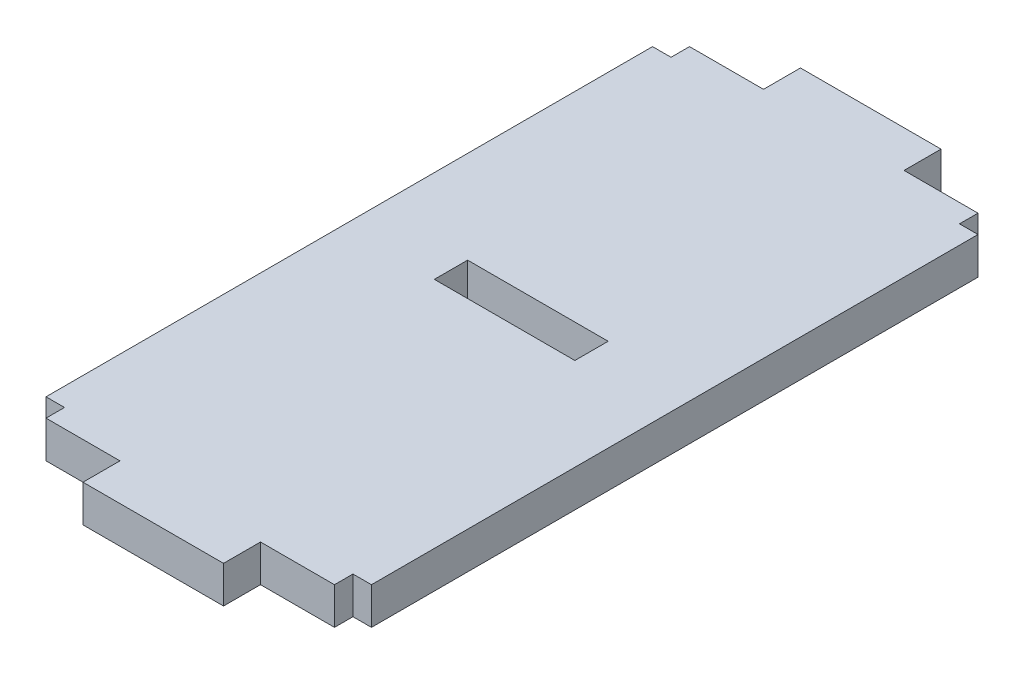
ISO-10303-21;
HEADER;
FILE_DESCRIPTION(('STEP AP214'),'2;1');
FILE_NAME('part.step','',(''),(''),'','','');
FILE_SCHEMA(('AUTOMOTIVE_DESIGN { 1 0 10303 214 1 1 1 1 }'));
ENDSEC;
DATA;
#1=APPLICATION_CONTEXT('core data for automotive mechanical design processes');
#2=APPLICATION_PROTOCOL_DEFINITION('international standard','automotive_design',2000,#1);
#3=PRODUCT_CONTEXT('',#1,'mechanical');
#4=PRODUCT('Part','Part','',(#3));
#5=PRODUCT_RELATED_PRODUCT_CATEGORY('part','',(#4));
#6=PRODUCT_DEFINITION_FORMATION('','',#4);
#7=PRODUCT_DEFINITION_CONTEXT('part definition',#1,'design');
#8=PRODUCT_DEFINITION('design','',#6,#7);
#9=PRODUCT_DEFINITION_SHAPE('','',#8);
#10=(LENGTH_UNIT() NAMED_UNIT(*) SI_UNIT(.MILLI.,.METRE.));
#11=(NAMED_UNIT(*) PLANE_ANGLE_UNIT() SI_UNIT($,.RADIAN.));
#12=(NAMED_UNIT(*) SI_UNIT($,.STERADIAN.) SOLID_ANGLE_UNIT());
#13=UNCERTAINTY_MEASURE_WITH_UNIT(LENGTH_MEASURE(1.E-05),#10,'distance_accuracy_value','');
#14=(GEOMETRIC_REPRESENTATION_CONTEXT(3) GLOBAL_UNCERTAINTY_ASSIGNED_CONTEXT((#13)) GLOBAL_UNIT_ASSIGNED_CONTEXT((#10,
#11,#12)) REPRESENTATION_CONTEXT('',''));
#15=CARTESIAN_POINT('',(0.,0.,0.));
#16=DIRECTION('',(0.,0.,1.));
#17=DIRECTION('',(1.,0.,0.));
#18=AXIS2_PLACEMENT_3D('',#15,#16,#17);
#19=CARTESIAN_POINT('',(0.,2.,-18.8));
#20=DIRECTION('',(0.,0.,-1.));
#21=DIRECTION('',(-1.,0.,0.));
#22=AXIS2_PLACEMENT_3D('',#19,#20,#21);
#23=PLANE('',#22);
#24=DIRECTION('',(1.,0.,0.));
#25=VECTOR('',#24,1.);
#26=CARTESIAN_POINT('',(0.,0.,-18.8));
#27=LINE('',#26,#25);
#28=CARTESIAN_POINT('',(5.,0.,-18.8));
#29=VERTEX_POINT('',#28);
#30=CARTESIAN_POINT('',(12.6,0.,-18.8));
#31=VERTEX_POINT('',#30);
#32=EDGE_CURVE('E279',#29,#31,#27,.T.);
#33=ORIENTED_EDGE('',*,*,#32,.T.);
#34=DIRECTION('',(0.,-1.,0.));
#35=VECTOR('',#34,1.);
#36=CARTESIAN_POINT('',(12.6,2.,-18.8));
#37=LINE('',#36,#35);
#38=CARTESIAN_POINT('',(12.6,2.,-18.8));
#39=VERTEX_POINT('',#38);
#40=EDGE_CURVE('E11',#39,#31,#37,.T.);
#41=ORIENTED_EDGE('',*,*,#40,.F.);
#42=DIRECTION('',(1.,0.,0.));
#43=VECTOR('',#42,1.);
#44=CARTESIAN_POINT('',(0.,2.,-18.8));
#45=LINE('',#44,#43);
#46=CARTESIAN_POINT('',(5.,2.,-18.8));
#47=VERTEX_POINT('',#46);
#48=EDGE_CURVE('E209',#47,#39,#45,.T.);
#49=ORIENTED_EDGE('',*,*,#48,.F.);
#50=DIRECTION('',(0.,-1.,0.));
#51=VECTOR('',#50,1.);
#52=CARTESIAN_POINT('',(5.,2.,-18.8));
#53=LINE('',#52,#51);
#54=EDGE_CURVE('E53',#47,#29,#53,.T.);
#55=ORIENTED_EDGE('',*,*,#54,.T.);
#56=EDGE_LOOP('',(#33,#41,#49,#55));
#57=FACE_BOUND('',#56,.T.);
#58=ADVANCED_FACE('F34',(#57),#23,.F.);
#59=CARTESIAN_POINT('',(12.6,2.,0.));
#60=DIRECTION('',(1.,0.,0.));
#61=DIRECTION('',(0.,0.,-1.));
#62=AXIS2_PLACEMENT_3D('',#59,#60,#61);
#63=PLANE('',#62);
#64=DIRECTION('',(0.,0.,1.));
#65=VECTOR('',#64,1.);
#66=CARTESIAN_POINT('',(12.6,0.,0.));
#67=LINE('',#66,#65);
#68=CARTESIAN_POINT('',(12.6,0.,-17.));
#69=VERTEX_POINT('',#68);
#70=EDGE_CURVE('E215',#31,#69,#67,.T.);
#71=ORIENTED_EDGE('',*,*,#70,.T.);
#72=DIRECTION('',(0.,-1.,0.));
#73=VECTOR('',#72,1.);
#74=CARTESIAN_POINT('',(12.6,2.,-17.));
#75=LINE('',#74,#73);
#76=CARTESIAN_POINT('',(12.6,2.,-17.));
#77=VERTEX_POINT('',#76);
#78=EDGE_CURVE('E44',#77,#69,#75,.T.);
#79=ORIENTED_EDGE('',*,*,#78,.F.);
#80=DIRECTION('',(0.,0.,1.));
#81=VECTOR('',#80,1.);
#82=CARTESIAN_POINT('',(12.6,2.,0.));
#83=LINE('',#82,#81);
#84=EDGE_CURVE('E203',#39,#77,#83,.T.);
#85=ORIENTED_EDGE('',*,*,#84,.F.);
#86=ORIENTED_EDGE('',*,*,#40,.T.);
#87=EDGE_LOOP('',(#71,#79,#85,#86));
#88=FACE_BOUND('',#87,.T.);
#89=ADVANCED_FACE('F214',(#88),#63,.F.);
#90=CARTESIAN_POINT('',(0.,2.,-17.));
#91=DIRECTION('',(0.,0.,-1.));
#92=DIRECTION('',(-1.,0.,0.));
#93=AXIS2_PLACEMENT_3D('',#90,#91,#92);
#94=PLANE('',#93);
#95=DIRECTION('',(1.,0.,0.));
#96=VECTOR('',#95,1.);
#97=CARTESIAN_POINT('',(0.,0.,-17.));
#98=LINE('',#97,#96);
#99=CARTESIAN_POINT('',(5.,0.,-17.));
#100=VERTEX_POINT('',#99);
#101=EDGE_CURVE('E282',#100,#69,#98,.T.);
#102=ORIENTED_EDGE('',*,*,#101,.F.);
#103=DIRECTION('',(0.,-1.,0.));
#104=VECTOR('',#103,1.);
#105=CARTESIAN_POINT('',(5.,2.,-17.));
#106=LINE('',#105,#104);
#107=CARTESIAN_POINT('',(5.,2.,-17.));
#108=VERTEX_POINT('',#107);
#109=EDGE_CURVE('E127',#108,#100,#106,.T.);
#110=ORIENTED_EDGE('',*,*,#109,.F.);
#111=DIRECTION('',(1.,0.,0.));
#112=VECTOR('',#111,1.);
#113=CARTESIAN_POINT('',(0.,2.,-17.));
#114=LINE('',#113,#112);
#115=EDGE_CURVE('E208',#108,#77,#114,.T.);
#116=ORIENTED_EDGE('',*,*,#115,.T.);
#117=ORIENTED_EDGE('',*,*,#78,.T.);
#118=EDGE_LOOP('',(#102,#110,#116,#117));
#119=FACE_BOUND('',#118,.T.);
#120=ADVANCED_FACE('F219',(#119),#94,.T.);
#121=CARTESIAN_POINT('',(1.,2.,0.));
#122=DIRECTION('',(-1.,0.,0.));
#123=DIRECTION('',(0.,0.,1.));
#124=AXIS2_PLACEMENT_3D('',#121,#122,#123);
#125=PLANE('',#124);
#126=DIRECTION('',(0.,0.,-1.));
#127=VECTOR('',#126,1.);
#128=CARTESIAN_POINT('',(1.,0.,0.));
#129=LINE('',#128,#127);
#130=CARTESIAN_POINT('',(1.,0.,0.));
#131=VERTEX_POINT('',#130);
#132=CARTESIAN_POINT('',(1.,0.,-1.));
#133=VERTEX_POINT('',#132);
#134=EDGE_CURVE('E226',#131,#133,#129,.T.);
#135=ORIENTED_EDGE('',*,*,#134,.F.);
#136=DIRECTION('',(0.,-1.,0.));
#137=VECTOR('',#136,1.);
#138=CARTESIAN_POINT('',(1.,2.,0.));
#139=LINE('',#138,#137);
#140=CARTESIAN_POINT('',(1.,2.,0.));
#141=VERTEX_POINT('',#140);
#142=EDGE_CURVE('E38',#141,#131,#139,.T.);
#143=ORIENTED_EDGE('',*,*,#142,.F.);
#144=DIRECTION('',(0.,0.,-1.));
#145=VECTOR('',#144,1.);
#146=CARTESIAN_POINT('',(1.,2.,0.));
#147=LINE('',#146,#145);
#148=CARTESIAN_POINT('',(1.,2.,-1.));
#149=VERTEX_POINT('',#148);
#150=EDGE_CURVE('E287',#141,#149,#147,.T.);
#151=ORIENTED_EDGE('',*,*,#150,.T.);
#152=DIRECTION('',(0.,-1.,0.));
#153=VECTOR('',#152,1.);
#154=CARTESIAN_POINT('',(1.,2.,-1.));
#155=LINE('',#154,#153);
#156=EDGE_CURVE('E222',#149,#133,#155,.T.);
#157=ORIENTED_EDGE('',*,*,#156,.T.);
#158=EDGE_LOOP('',(#135,#143,#151,#157));
#159=FACE_BOUND('',#158,.T.);
#160=ADVANCED_FACE('F36',(#159),#125,.T.);
#161=CARTESIAN_POINT('',(0.,2.,0.));
#162=DIRECTION('',(0.,0.,-1.));
#163=DIRECTION('',(-1.,0.,0.));
#164=AXIS2_PLACEMENT_3D('',#161,#162,#163);
#165=PLANE('',#164);
#166=DIRECTION('',(1.,0.,0.));
#167=VECTOR('',#166,1.);
#168=CARTESIAN_POINT('',(0.,0.,0.));
#169=LINE('',#168,#167);
#170=CARTESIAN_POINT('',(5.,0.,0.));
#171=VERTEX_POINT('',#170);
#172=EDGE_CURVE('E229',#131,#171,#169,.T.);
#173=ORIENTED_EDGE('',*,*,#172,.T.);
#174=DIRECTION('',(0.,-1.,0.));
#175=VECTOR('',#174,1.);
#176=CARTESIAN_POINT('',(5.,2.,0.));
#177=LINE('',#176,#175);
#178=CARTESIAN_POINT('',(5.,2.,0.));
#179=VERTEX_POINT('',#178);
#180=EDGE_CURVE('E327',#179,#171,#177,.T.);
#181=ORIENTED_EDGE('',*,*,#180,.F.);
#182=DIRECTION('',(1.,0.,0.));
#183=VECTOR('',#182,1.);
#184=CARTESIAN_POINT('',(0.,2.,0.));
#185=LINE('',#184,#183);
#186=EDGE_CURVE('E336',#141,#179,#185,.T.);
#187=ORIENTED_EDGE('',*,*,#186,.F.);
#188=ORIENTED_EDGE('',*,*,#142,.T.);
#189=EDGE_LOOP('',(#173,#181,#187,#188));
#190=FACE_BOUND('',#189,.T.);
#191=ADVANCED_FACE('F335',(#190),#165,.F.);
#192=CARTESIAN_POINT('',(5.,2.,0.));
#193=DIRECTION('',(1.,0.,0.));
#194=DIRECTION('',(0.,0.,-1.));
#195=AXIS2_PLACEMENT_3D('',#192,#193,#194);
#196=PLANE('',#195);
#197=DIRECTION('',(0.,0.,1.));
#198=VECTOR('',#197,1.);
#199=CARTESIAN_POINT('',(5.,0.,0.));
#200=LINE('',#199,#198);
#201=CARTESIAN_POINT('',(5.,0.,2.));
#202=VERTEX_POINT('',#201);
#203=EDGE_CURVE('E231',#171,#202,#200,.T.);
#204=ORIENTED_EDGE('',*,*,#203,.T.);
#205=DIRECTION('',(0.,-1.,0.));
#206=VECTOR('',#205,1.);
#207=CARTESIAN_POINT('',(5.,2.,2.));
#208=LINE('',#207,#206);
#209=CARTESIAN_POINT('',(5.,2.,2.));
#210=VERTEX_POINT('',#209);
#211=EDGE_CURVE('E325',#210,#202,#208,.T.);
#212=ORIENTED_EDGE('',*,*,#211,.F.);
#213=DIRECTION('',(0.,0.,1.));
#214=VECTOR('',#213,1.);
#215=CARTESIAN_POINT('',(5.,2.,0.));
#216=LINE('',#215,#214);
#217=EDGE_CURVE('E434',#179,#210,#216,.T.);
#218=ORIENTED_EDGE('',*,*,#217,.F.);
#219=ORIENTED_EDGE('',*,*,#180,.T.);
#220=EDGE_LOOP('',(#204,#212,#218,#219));
#221=FACE_BOUND('',#220,.T.);
#222=ADVANCED_FACE('F433',(#221),#196,.F.);
#223=CARTESIAN_POINT('',(0.,2.,2.));
#224=DIRECTION('',(0.,0.,-1.));
#225=DIRECTION('',(-1.,0.,0.));
#226=AXIS2_PLACEMENT_3D('',#223,#224,#225);
#227=PLANE('',#226);
#228=DIRECTION('',(1.,0.,0.));
#229=VECTOR('',#228,1.);
#230=CARTESIAN_POINT('',(0.,0.,2.));
#231=LINE('',#230,#229);
#232=CARTESIAN_POINT('',(12.6,0.,2.));
#233=VERTEX_POINT('',#232);
#234=EDGE_CURVE('E234',#202,#233,#231,.T.);
#235=ORIENTED_EDGE('',*,*,#234,.T.);
#236=DIRECTION('',(0.,-1.,0.));
#237=VECTOR('',#236,1.);
#238=CARTESIAN_POINT('',(12.6,2.,2.));
#239=LINE('',#238,#237);
#240=CARTESIAN_POINT('',(12.6,2.,2.));
#241=VERTEX_POINT('',#240);
#242=EDGE_CURVE('E323',#241,#233,#239,.T.);
#243=ORIENTED_EDGE('',*,*,#242,.F.);
#244=DIRECTION('',(1.,0.,0.));
#245=VECTOR('',#244,1.);
#246=CARTESIAN_POINT('',(0.,2.,2.));
#247=LINE('',#246,#245);
#248=EDGE_CURVE('E432',#210,#241,#247,.T.);
#249=ORIENTED_EDGE('',*,*,#248,.F.);
#250=ORIENTED_EDGE('',*,*,#211,.T.);
#251=EDGE_LOOP('',(#235,#243,#249,#250));
#252=FACE_BOUND('',#251,.T.);
#253=ADVANCED_FACE('F430',(#252),#227,.F.);
#254=CARTESIAN_POINT('',(12.6,2.,0.));
#255=DIRECTION('',(1.,0.,0.));
#256=DIRECTION('',(0.,0.,-1.));
#257=AXIS2_PLACEMENT_3D('',#254,#255,#256);
#258=PLANE('',#257);
#259=DIRECTION('',(0.,0.,1.));
#260=VECTOR('',#259,1.);
#261=CARTESIAN_POINT('',(12.6,0.,0.));
#262=LINE('',#261,#260);
#263=CARTESIAN_POINT('',(12.6,0.,0.));
#264=VERTEX_POINT('',#263);
#265=EDGE_CURVE('E237',#264,#233,#262,.T.);
#266=ORIENTED_EDGE('',*,*,#265,.F.);
#267=DIRECTION('',(0.,-1.,0.));
#268=VECTOR('',#267,1.);
#269=CARTESIAN_POINT('',(12.6,2.,0.));
#270=LINE('',#269,#268);
#271=CARTESIAN_POINT('',(12.6,2.,0.));
#272=VERTEX_POINT('',#271);
#273=EDGE_CURVE('E321',#272,#264,#270,.T.);
#274=ORIENTED_EDGE('',*,*,#273,.F.);
#275=DIRECTION('',(0.,0.,1.));
#276=VECTOR('',#275,1.);
#277=CARTESIAN_POINT('',(12.6,2.,0.));
#278=LINE('',#277,#276);
#279=EDGE_CURVE('E427',#272,#241,#278,.T.);
#280=ORIENTED_EDGE('',*,*,#279,.T.);
#281=ORIENTED_EDGE('',*,*,#242,.T.);
#282=EDGE_LOOP('',(#266,#274,#280,#281));
#283=FACE_BOUND('',#282,.T.);
#284=ADVANCED_FACE('F422',(#283),#258,.T.);
#285=CARTESIAN_POINT('',(16.6,0.,0.));
#286=VERTEX_POINT('',#285);
#287=EDGE_CURVE('E232',#264,#286,#169,.T.);
#288=ORIENTED_EDGE('',*,*,#287,.T.);
#289=DIRECTION('',(0.,-1.,0.));
#290=VECTOR('',#289,1.);
#291=CARTESIAN_POINT('',(16.6,2.,0.));
#292=LINE('',#291,#290);
#293=CARTESIAN_POINT('',(16.6,2.,0.));
#294=VERTEX_POINT('',#293);
#295=EDGE_CURVE('E318',#294,#286,#292,.T.);
#296=ORIENTED_EDGE('',*,*,#295,.F.);
#297=EDGE_CURVE('E439',#272,#294,#185,.T.);
#298=ORIENTED_EDGE('',*,*,#297,.F.);
#299=ORIENTED_EDGE('',*,*,#273,.T.);
#300=EDGE_LOOP('',(#288,#296,#298,#299));
#301=FACE_BOUND('',#300,.T.);
#302=ADVANCED_FACE('F621',(#301),#165,.F.);
#303=CARTESIAN_POINT('',(16.6,2.,0.));
#304=DIRECTION('',(-1.,0.,0.));
#305=DIRECTION('',(0.,0.,1.));
#306=AXIS2_PLACEMENT_3D('',#303,#304,#305);
#307=PLANE('',#306);
#308=DIRECTION('',(0.,0.,-1.));
#309=VECTOR('',#308,1.);
#310=CARTESIAN_POINT('',(16.6,0.,0.));
#311=LINE('',#310,#309);
#312=CARTESIAN_POINT('',(16.6,0.,-1.));
#313=VERTEX_POINT('',#312);
#314=EDGE_CURVE('E240',#286,#313,#311,.T.);
#315=ORIENTED_EDGE('',*,*,#314,.T.);
#316=DIRECTION('',(0.,-1.,0.));
#317=VECTOR('',#316,1.);
#318=CARTESIAN_POINT('',(16.6,2.,-1.));
#319=LINE('',#318,#317);
#320=CARTESIAN_POINT('',(16.6,2.,-1.));
#321=VERTEX_POINT('',#320);
#322=EDGE_CURVE('E316',#321,#313,#319,.T.);
#323=ORIENTED_EDGE('',*,*,#322,.F.);
#324=DIRECTION('',(0.,0.,-1.));
#325=VECTOR('',#324,1.);
#326=CARTESIAN_POINT('',(16.6,2.,0.));
#327=LINE('',#326,#325);
#328=EDGE_CURVE('E443',#294,#321,#327,.T.);
#329=ORIENTED_EDGE('',*,*,#328,.F.);
#330=ORIENTED_EDGE('',*,*,#295,.T.);
#331=EDGE_LOOP('',(#315,#323,#329,#330));
#332=FACE_BOUND('',#331,.T.);
#333=ADVANCED_FACE('F416',(#332),#307,.F.);
#334=CARTESIAN_POINT('',(0.,2.,-0.999999999999996));
#335=DIRECTION('',(0.,0.,1.));
#336=DIRECTION('',(1.,0.,0.));
#337=AXIS2_PLACEMENT_3D('',#334,#335,#336);
#338=PLANE('',#337);
#339=DIRECTION('',(-1.,0.,0.));
#340=VECTOR('',#339,1.);
#341=CARTESIAN_POINT('',(0.,0.,-0.999999999999996));
#342=LINE('',#341,#340);
#343=CARTESIAN_POINT('',(17.6,0.,-1.));
#344=VERTEX_POINT('',#343);
#345=EDGE_CURVE('E243',#344,#313,#342,.T.);
#346=ORIENTED_EDGE('',*,*,#345,.F.);
#347=DIRECTION('',(0.,-1.,0.));
#348=VECTOR('',#347,1.);
#349=CARTESIAN_POINT('',(17.6,2.,-1.));
#350=LINE('',#349,#348);
#351=CARTESIAN_POINT('',(17.6,2.,-1.));
#352=VERTEX_POINT('',#351);
#353=EDGE_CURVE('E314',#352,#344,#350,.T.);
#354=ORIENTED_EDGE('',*,*,#353,.F.);
#355=DIRECTION('',(-1.,0.,0.));
#356=VECTOR('',#355,1.);
#357=CARTESIAN_POINT('',(0.,2.,-0.999999999999996));
#358=LINE('',#357,#356);
#359=EDGE_CURVE('E413',#352,#321,#358,.T.);
#360=ORIENTED_EDGE('',*,*,#359,.T.);
#361=ORIENTED_EDGE('',*,*,#322,.T.);
#362=EDGE_LOOP('',(#346,#354,#360,#361));
#363=FACE_BOUND('',#362,.T.);
#364=ADVANCED_FACE('F408',(#363),#338,.T.);
#365=CARTESIAN_POINT('',(17.6,2.,0.));
#366=DIRECTION('',(-1.,0.,0.));
#367=DIRECTION('',(0.,0.,1.));
#368=AXIS2_PLACEMENT_3D('',#365,#366,#367);
#369=PLANE('',#368);
#370=DIRECTION('',(0.,0.,-1.));
#371=VECTOR('',#370,1.);
#372=CARTESIAN_POINT('',(17.6,0.,0.));
#373=LINE('',#372,#371);
#374=CARTESIAN_POINT('',(17.6,0.,-33.8));
#375=VERTEX_POINT('',#374);
#376=EDGE_CURVE('E246',#344,#375,#373,.T.);
#377=ORIENTED_EDGE('',*,*,#376,.T.);
#378=DIRECTION('',(0.,-1.,0.));
#379=VECTOR('',#378,1.);
#380=CARTESIAN_POINT('',(17.6,2.,-33.8));
#381=LINE('',#380,#379);
#382=CARTESIAN_POINT('',(17.6,2.,-33.8));
#383=VERTEX_POINT('',#382);
#384=EDGE_CURVE('E311',#383,#375,#381,.T.);
#385=ORIENTED_EDGE('',*,*,#384,.F.);
#386=DIRECTION('',(0.,0.,-1.));
#387=VECTOR('',#386,1.);
#388=CARTESIAN_POINT('',(17.6,2.,0.));
#389=LINE('',#388,#387);
#390=EDGE_CURVE('E446',#352,#383,#389,.T.);
#391=ORIENTED_EDGE('',*,*,#390,.F.);
#392=ORIENTED_EDGE('',*,*,#353,.T.);
#393=EDGE_LOOP('',(#377,#385,#391,#392));
#394=FACE_BOUND('',#393,.T.);
#395=ADVANCED_FACE('F596',(#394),#369,.F.);
#396=CARTESIAN_POINT('',(0.,2.,-33.8));
#397=DIRECTION('',(0.,0.,1.));
#398=DIRECTION('',(1.,0.,0.));
#399=AXIS2_PLACEMENT_3D('',#396,#397,#398);
#400=PLANE('',#399);
#401=DIRECTION('',(-1.,0.,0.));
#402=VECTOR('',#401,1.);
#403=CARTESIAN_POINT('',(0.,0.,-33.8));
#404=LINE('',#403,#402);
#405=CARTESIAN_POINT('',(16.6,0.,-33.8));
#406=VERTEX_POINT('',#405);
#407=EDGE_CURVE('E248',#375,#406,#404,.T.);
#408=ORIENTED_EDGE('',*,*,#407,.T.);
#409=DIRECTION('',(0.,-1.,0.));
#410=VECTOR('',#409,1.);
#411=CARTESIAN_POINT('',(16.6,2.,-33.8));
#412=LINE('',#411,#410);
#413=CARTESIAN_POINT('',(16.6,2.,-33.8));
#414=VERTEX_POINT('',#413);
#415=EDGE_CURVE('E309',#414,#406,#412,.T.);
#416=ORIENTED_EDGE('',*,*,#415,.F.);
#417=DIRECTION('',(-1.,0.,0.));
#418=VECTOR('',#417,1.);
#419=CARTESIAN_POINT('',(0.,2.,-33.8));
#420=LINE('',#419,#418);
#421=EDGE_CURVE('E448',#383,#414,#420,.T.);
#422=ORIENTED_EDGE('',*,*,#421,.F.);
#423=ORIENTED_EDGE('',*,*,#384,.T.);
#424=EDGE_LOOP('',(#408,#416,#422,#423));
#425=FACE_BOUND('',#424,.T.);
#426=ADVANCED_FACE('F401',(#425),#400,.F.);
#427=CARTESIAN_POINT('',(16.6,2.,0.));
#428=DIRECTION('',(1.,0.,0.));
#429=DIRECTION('',(0.,0.,-1.));
#430=AXIS2_PLACEMENT_3D('',#427,#428,#429);
#431=PLANE('',#430);
#432=DIRECTION('',(0.,0.,1.));
#433=VECTOR('',#432,1.);
#434=CARTESIAN_POINT('',(16.6,0.,0.));
#435=LINE('',#434,#433);
#436=CARTESIAN_POINT('',(16.6,0.,-34.8));
#437=VERTEX_POINT('',#436);
#438=EDGE_CURVE('E251',#437,#406,#435,.T.);
#439=ORIENTED_EDGE('',*,*,#438,.F.);
#440=DIRECTION('',(0.,-1.,0.));
#441=VECTOR('',#440,1.);
#442=CARTESIAN_POINT('',(16.6,2.,-34.8));
#443=LINE('',#442,#441);
#444=CARTESIAN_POINT('',(16.6,2.,-34.8));
#445=VERTEX_POINT('',#444);
#446=EDGE_CURVE('E307',#445,#437,#443,.T.);
#447=ORIENTED_EDGE('',*,*,#446,.F.);
#448=DIRECTION('',(0.,0.,1.));
#449=VECTOR('',#448,1.);
#450=CARTESIAN_POINT('',(16.6,2.,0.));
#451=LINE('',#450,#449);
#452=EDGE_CURVE('E398',#445,#414,#451,.T.);
#453=ORIENTED_EDGE('',*,*,#452,.T.);
#454=ORIENTED_EDGE('',*,*,#415,.T.);
#455=EDGE_LOOP('',(#439,#447,#453,#454));
#456=FACE_BOUND('',#455,.T.);
#457=ADVANCED_FACE('F396',(#456),#431,.T.);
#458=CARTESIAN_POINT('',(0.,2.,-34.8));
#459=DIRECTION('',(0.,0.,-1.));
#460=DIRECTION('',(-1.,0.,0.));
#461=AXIS2_PLACEMENT_3D('',#458,#459,#460);
#462=PLANE('',#461);
#463=DIRECTION('',(1.,0.,0.));
#464=VECTOR('',#463,1.);
#465=CARTESIAN_POINT('',(0.,0.,-34.8));
#466=LINE('',#465,#464);
#467=CARTESIAN_POINT('',(12.6,0.,-34.8));
#468=VERTEX_POINT('',#467);
#469=EDGE_CURVE('E254',#468,#437,#466,.T.);
#470=ORIENTED_EDGE('',*,*,#469,.F.);
#471=DIRECTION('',(0.,-1.,0.));
#472=VECTOR('',#471,1.);
#473=CARTESIAN_POINT('',(12.6,2.,-34.8));
#474=LINE('',#473,#472);
#475=CARTESIAN_POINT('',(12.6,2.,-34.8));
#476=VERTEX_POINT('',#475);
#477=EDGE_CURVE('E305',#476,#468,#474,.T.);
#478=ORIENTED_EDGE('',*,*,#477,.F.);
#479=DIRECTION('',(1.,0.,0.));
#480=VECTOR('',#479,1.);
#481=CARTESIAN_POINT('',(0.,2.,-34.8));
#482=LINE('',#481,#480);
#483=EDGE_CURVE('E392',#476,#445,#482,.T.);
#484=ORIENTED_EDGE('',*,*,#483,.T.);
#485=ORIENTED_EDGE('',*,*,#446,.T.);
#486=EDGE_LOOP('',(#470,#478,#484,#485));
#487=FACE_BOUND('',#486,.T.);
#488=ADVANCED_FACE('F389',(#487),#462,.T.);
#489=CARTESIAN_POINT('',(12.6,2.,0.));
#490=DIRECTION('',(1.,0.,0.));
#491=DIRECTION('',(0.,0.,-1.));
#492=AXIS2_PLACEMENT_3D('',#489,#490,#491);
#493=PLANE('',#492);
#494=DIRECTION('',(0.,0.,1.));
#495=VECTOR('',#494,1.);
#496=CARTESIAN_POINT('',(12.6,0.,0.));
#497=LINE('',#496,#495);
#498=CARTESIAN_POINT('',(12.6,0.,-36.8));
#499=VERTEX_POINT('',#498);
#500=EDGE_CURVE('E257',#499,#468,#497,.T.);
#501=ORIENTED_EDGE('',*,*,#500,.F.);
#502=DIRECTION('',(0.,-1.,0.));
#503=VECTOR('',#502,1.);
#504=CARTESIAN_POINT('',(12.6,2.,-36.8));
#505=LINE('',#504,#503);
#506=CARTESIAN_POINT('',(12.6,2.,-36.8));
#507=VERTEX_POINT('',#506);
#508=EDGE_CURVE('E303',#507,#499,#505,.T.);
#509=ORIENTED_EDGE('',*,*,#508,.F.);
#510=DIRECTION('',(0.,0.,1.));
#511=VECTOR('',#510,1.);
#512=CARTESIAN_POINT('',(12.6,2.,0.));
#513=LINE('',#512,#511);
#514=EDGE_CURVE('E452',#507,#476,#513,.T.);
#515=ORIENTED_EDGE('',*,*,#514,.T.);
#516=ORIENTED_EDGE('',*,*,#477,.T.);
#517=EDGE_LOOP('',(#501,#509,#515,#516));
#518=FACE_BOUND('',#517,.T.);
#519=ADVANCED_FACE('F384',(#518),#493,.T.);
#520=CARTESIAN_POINT('',(0.,2.,-36.8));
#521=DIRECTION('',(0.,0.,-1.));
#522=DIRECTION('',(-1.,0.,0.));
#523=AXIS2_PLACEMENT_3D('',#520,#521,#522);
#524=PLANE('',#523);
#525=DIRECTION('',(1.,0.,0.));
#526=VECTOR('',#525,1.);
#527=CARTESIAN_POINT('',(0.,0.,-36.8));
#528=LINE('',#527,#526);
#529=CARTESIAN_POINT('',(5.,0.,-36.8));
#530=VERTEX_POINT('',#529);
#531=EDGE_CURVE('E261',#530,#499,#528,.T.);
#532=ORIENTED_EDGE('',*,*,#531,.F.);
#533=DIRECTION('',(0.,-1.,0.));
#534=VECTOR('',#533,1.);
#535=CARTESIAN_POINT('',(5.,2.,-36.8));
#536=LINE('',#535,#534);
#537=CARTESIAN_POINT('',(5.,2.,-36.8));
#538=VERTEX_POINT('',#537);
#539=EDGE_CURVE('E301',#538,#530,#536,.T.);
#540=ORIENTED_EDGE('',*,*,#539,.F.);
#541=DIRECTION('',(1.,0.,0.));
#542=VECTOR('',#541,1.);
#543=CARTESIAN_POINT('',(0.,2.,-36.8));
#544=LINE('',#543,#542);
#545=EDGE_CURVE('E380',#538,#507,#544,.T.);
#546=ORIENTED_EDGE('',*,*,#545,.T.);
#547=ORIENTED_EDGE('',*,*,#508,.T.);
#548=EDGE_LOOP('',(#532,#540,#546,#547));
#549=FACE_BOUND('',#548,.T.);
#550=ADVANCED_FACE('F376',(#549),#524,.T.);
#551=CARTESIAN_POINT('',(5.,2.,0.));
#552=DIRECTION('',(1.,0.,0.));
#553=DIRECTION('',(0.,0.,-1.));
#554=AXIS2_PLACEMENT_3D('',#551,#552,#553);
#555=PLANE('',#554);
#556=DIRECTION('',(0.,0.,1.));
#557=VECTOR('',#556,1.);
#558=CARTESIAN_POINT('',(5.,0.,0.));
#559=LINE('',#558,#557);
#560=CARTESIAN_POINT('',(5.,0.,-34.8));
#561=VERTEX_POINT('',#560);
#562=EDGE_CURVE('E264',#530,#561,#559,.T.);
#563=ORIENTED_EDGE('',*,*,#562,.T.);
#564=DIRECTION('',(0.,-1.,0.));
#565=VECTOR('',#564,1.);
#566=CARTESIAN_POINT('',(5.,2.,-34.8));
#567=LINE('',#566,#565);
#568=CARTESIAN_POINT('',(5.,2.,-34.8));
#569=VERTEX_POINT('',#568);
#570=EDGE_CURVE('E299',#569,#561,#567,.T.);
#571=ORIENTED_EDGE('',*,*,#570,.F.);
#572=DIRECTION('',(0.,0.,1.));
#573=VECTOR('',#572,1.);
#574=CARTESIAN_POINT('',(5.,2.,0.));
#575=LINE('',#574,#573);
#576=EDGE_CURVE('E455',#538,#569,#575,.T.);
#577=ORIENTED_EDGE('',*,*,#576,.F.);
#578=ORIENTED_EDGE('',*,*,#539,.T.);
#579=EDGE_LOOP('',(#563,#571,#577,#578));
#580=FACE_BOUND('',#579,.T.);
#581=ADVANCED_FACE('F373',(#580),#555,.F.);
#582=CARTESIAN_POINT('',(1.,0.,-34.8));
#583=VERTEX_POINT('',#582);
#584=EDGE_CURVE('E258',#583,#561,#466,.T.);
#585=ORIENTED_EDGE('',*,*,#584,.F.);
#586=DIRECTION('',(0.,-1.,0.));
#587=VECTOR('',#586,1.);
#588=CARTESIAN_POINT('',(1.,2.,-34.8));
#589=LINE('',#588,#587);
#590=CARTESIAN_POINT('',(1.,2.,-34.8));
#591=VERTEX_POINT('',#590);
#592=EDGE_CURVE('E297',#591,#583,#589,.T.);
#593=ORIENTED_EDGE('',*,*,#592,.F.);
#594=EDGE_CURVE('E370',#591,#569,#482,.T.);
#595=ORIENTED_EDGE('',*,*,#594,.T.);
#596=ORIENTED_EDGE('',*,*,#570,.T.);
#597=EDGE_LOOP('',(#585,#593,#595,#596));
#598=FACE_BOUND('',#597,.T.);
#599=ADVANCED_FACE('F365',(#598),#462,.T.);
#600=CARTESIAN_POINT('',(1.00000000000001,2.,0.));
#601=DIRECTION('',(1.,0.,0.));
#602=DIRECTION('',(0.,0.,-1.));
#603=AXIS2_PLACEMENT_3D('',#600,#601,#602);
#604=PLANE('',#603);
#605=DIRECTION('',(0.,0.,1.));
#606=VECTOR('',#605,1.);
#607=CARTESIAN_POINT('',(1.00000000000001,0.,0.));
#608=LINE('',#607,#606);
#609=CARTESIAN_POINT('',(1.,0.,-33.8));
#610=VERTEX_POINT('',#609);
#611=EDGE_CURVE('E267',#583,#610,#608,.T.);
#612=ORIENTED_EDGE('',*,*,#611,.T.);
#613=DIRECTION('',(0.,-1.,0.));
#614=VECTOR('',#613,1.);
#615=CARTESIAN_POINT('',(1.,2.,-33.8));
#616=LINE('',#615,#614);
#617=CARTESIAN_POINT('',(1.,2.,-33.8));
#618=VERTEX_POINT('',#617);
#619=EDGE_CURVE('E295',#618,#610,#616,.T.);
#620=ORIENTED_EDGE('',*,*,#619,.F.);
#621=DIRECTION('',(0.,0.,1.));
#622=VECTOR('',#621,1.);
#623=CARTESIAN_POINT('',(1.00000000000001,2.,0.));
#624=LINE('',#623,#622);
#625=EDGE_CURVE('E457',#591,#618,#624,.T.);
#626=ORIENTED_EDGE('',*,*,#625,.F.);
#627=ORIENTED_EDGE('',*,*,#592,.T.);
#628=EDGE_LOOP('',(#612,#620,#626,#627));
#629=FACE_BOUND('',#628,.T.);
#630=ADVANCED_FACE('F463',(#629),#604,.F.);
#631=CARTESIAN_POINT('',(0.,2.,-33.8));
#632=DIRECTION('',(0.,0.,-1.));
#633=DIRECTION('',(-1.,0.,0.));
#634=AXIS2_PLACEMENT_3D('',#631,#632,#633);
#635=PLANE('',#634);
#636=DIRECTION('',(1.,0.,0.));
#637=VECTOR('',#636,1.);
#638=CARTESIAN_POINT('',(0.,0.,-33.8));
#639=LINE('',#638,#637);
#640=CARTESIAN_POINT('',(0.,0.,-33.8));
#641=VERTEX_POINT('',#640);
#642=EDGE_CURVE('E270',#641,#610,#639,.T.);
#643=ORIENTED_EDGE('',*,*,#642,.F.);
#644=DIRECTION('',(0.,-1.,0.));
#645=VECTOR('',#644,1.);
#646=CARTESIAN_POINT('',(0.,2.,-33.8));
#647=LINE('',#646,#645);
#648=CARTESIAN_POINT('',(0.,2.,-33.8));
#649=VERTEX_POINT('',#648);
#650=EDGE_CURVE('E293',#649,#641,#647,.T.);
#651=ORIENTED_EDGE('',*,*,#650,.F.);
#652=DIRECTION('',(1.,0.,0.));
#653=VECTOR('',#652,1.);
#654=CARTESIAN_POINT('',(0.,2.,-33.8));
#655=LINE('',#654,#653);
#656=EDGE_CURVE('E459',#649,#618,#655,.T.);
#657=ORIENTED_EDGE('',*,*,#656,.T.);
#658=ORIENTED_EDGE('',*,*,#619,.T.);
#659=EDGE_LOOP('',(#643,#651,#657,#658));
#660=FACE_BOUND('',#659,.T.);
#661=ADVANCED_FACE('F357',(#660),#635,.T.);
#662=CARTESIAN_POINT('',(0.,2.,0.));
#663=DIRECTION('',(-1.,0.,0.));
#664=DIRECTION('',(0.,0.,1.));
#665=AXIS2_PLACEMENT_3D('',#662,#663,#664);
#666=PLANE('',#665);
#667=DIRECTION('',(0.,0.,-1.));
#668=VECTOR('',#667,1.);
#669=CARTESIAN_POINT('',(0.,0.,0.));
#670=LINE('',#669,#668);
#671=CARTESIAN_POINT('',(0.,0.,-1.));
#672=VERTEX_POINT('',#671);
#673=EDGE_CURVE('E273',#672,#641,#670,.T.);
#674=ORIENTED_EDGE('',*,*,#673,.F.);
#675=DIRECTION('',(0.,-1.,0.));
#676=VECTOR('',#675,1.);
#677=CARTESIAN_POINT('',(0.,2.,-1.));
#678=LINE('',#677,#676);
#679=CARTESIAN_POINT('',(0.,2.,-1.));
#680=VERTEX_POINT('',#679);
#681=EDGE_CURVE('E291',#680,#672,#678,.T.);
#682=ORIENTED_EDGE('',*,*,#681,.F.);
#683=DIRECTION('',(0.,0.,-1.));
#684=VECTOR('',#683,1.);
#685=CARTESIAN_POINT('',(0.,2.,0.));
#686=LINE('',#685,#684);
#687=EDGE_CURVE('E353',#680,#649,#686,.T.);
#688=ORIENTED_EDGE('',*,*,#687,.T.);
#689=ORIENTED_EDGE('',*,*,#650,.T.);
#690=EDGE_LOOP('',(#674,#682,#688,#689));
#691=FACE_BOUND('',#690,.T.);
#692=ADVANCED_FACE('F349',(#691),#666,.T.);
#693=CARTESIAN_POINT('',(0.,2.,-1.));
#694=DIRECTION('',(0.,0.,-1.));
#695=DIRECTION('',(-1.,0.,0.));
#696=AXIS2_PLACEMENT_3D('',#693,#694,#695);
#697=PLANE('',#696);
#698=DIRECTION('',(1.,0.,0.));
#699=VECTOR('',#698,1.);
#700=CARTESIAN_POINT('',(0.,0.,-1.));
#701=LINE('',#700,#699);
#702=EDGE_CURVE('E276',#672,#133,#701,.T.);
#703=ORIENTED_EDGE('',*,*,#702,.T.);
#704=ORIENTED_EDGE('',*,*,#156,.F.);
#705=DIRECTION('',(1.,0.,0.));
#706=VECTOR('',#705,1.);
#707=CARTESIAN_POINT('',(0.,2.,-1.));
#708=LINE('',#707,#706);
#709=EDGE_CURVE('E462',#680,#149,#708,.T.);
#710=ORIENTED_EDGE('',*,*,#709,.F.);
#711=ORIENTED_EDGE('',*,*,#681,.T.);
#712=EDGE_LOOP('',(#703,#704,#710,#711));
#713=FACE_BOUND('',#712,.T.);
#714=ADVANCED_FACE('F346',(#713),#697,.F.);
#715=CARTESIAN_POINT('',(5.,2.,0.));
#716=DIRECTION('',(1.,0.,0.));
#717=DIRECTION('',(0.,0.,-1.));
#718=AXIS2_PLACEMENT_3D('',#715,#716,#717);
#719=PLANE('',#718);
#720=DIRECTION('',(0.,0.,1.));
#721=VECTOR('',#720,1.);
#722=CARTESIAN_POINT('',(5.,0.,0.));
#723=LINE('',#722,#721);
#724=EDGE_CURVE('E284',#29,#100,#723,.T.);
#725=ORIENTED_EDGE('',*,*,#724,.F.);
#726=ORIENTED_EDGE('',*,*,#54,.F.);
#727=DIRECTION('',(0.,0.,1.));
#728=VECTOR('',#727,1.);
#729=CARTESIAN_POINT('',(5.,2.,0.));
#730=LINE('',#729,#728);
#731=EDGE_CURVE('E220',#47,#108,#730,.T.);
#732=ORIENTED_EDGE('',*,*,#731,.T.);
#733=ORIENTED_EDGE('',*,*,#109,.T.);
#734=EDGE_LOOP('',(#725,#726,#732,#733));
#735=FACE_BOUND('',#734,.T.);
#736=ADVANCED_FACE('F482',(#735),#719,.T.);
#737=CARTESIAN_POINT('',(0.,2.,0.));
#738=DIRECTION('',(0.,1.,0.));
#739=DIRECTION('',(0.,0.,1.));
#740=AXIS2_PLACEMENT_3D('',#737,#738,#739);
#741=PLANE('',#740);
#742=ORIENTED_EDGE('',*,*,#150,.F.);
#743=ORIENTED_EDGE('',*,*,#186,.T.);
#744=ORIENTED_EDGE('',*,*,#217,.T.);
#745=ORIENTED_EDGE('',*,*,#248,.T.);
#746=ORIENTED_EDGE('',*,*,#279,.F.);
#747=ORIENTED_EDGE('',*,*,#297,.T.);
#748=ORIENTED_EDGE('',*,*,#328,.T.);
#749=ORIENTED_EDGE('',*,*,#359,.F.);
#750=ORIENTED_EDGE('',*,*,#390,.T.);
#751=ORIENTED_EDGE('',*,*,#421,.T.);
#752=ORIENTED_EDGE('',*,*,#452,.F.);
#753=ORIENTED_EDGE('',*,*,#483,.F.);
#754=ORIENTED_EDGE('',*,*,#514,.F.);
#755=ORIENTED_EDGE('',*,*,#545,.F.);
#756=ORIENTED_EDGE('',*,*,#576,.T.);
#757=ORIENTED_EDGE('',*,*,#594,.F.);
#758=ORIENTED_EDGE('',*,*,#625,.T.);
#759=ORIENTED_EDGE('',*,*,#656,.F.);
#760=ORIENTED_EDGE('',*,*,#687,.F.);
#761=ORIENTED_EDGE('',*,*,#709,.T.);
#762=EDGE_LOOP('',(#742,#743,#744,#745,#746,#747,#748,#749,#750,#751,#752,#753,#754,#755,#756,
#757,#758,#759,#760,#761));
#763=FACE_BOUND('',#762,.T.);
#764=ORIENTED_EDGE('',*,*,#48,.T.);
#765=ORIENTED_EDGE('',*,*,#84,.T.);
#766=ORIENTED_EDGE('',*,*,#115,.F.);
#767=ORIENTED_EDGE('',*,*,#731,.F.);
#768=EDGE_LOOP('',(#764,#765,#766,#767));
#769=FACE_BOUND('',#768,.T.);
#770=ADVANCED_FACE('F205',(#763,#769),#741,.T.);
#771=CARTESIAN_POINT('',(0.,0.,0.));
#772=DIRECTION('',(0.,1.,0.));
#773=DIRECTION('',(0.,0.,1.));
#774=AXIS2_PLACEMENT_3D('',#771,#772,#773);
#775=PLANE('',#774);
#776=ORIENTED_EDGE('',*,*,#134,.T.);
#777=ORIENTED_EDGE('',*,*,#702,.F.);
#778=ORIENTED_EDGE('',*,*,#673,.T.);
#779=ORIENTED_EDGE('',*,*,#642,.T.);
#780=ORIENTED_EDGE('',*,*,#611,.F.);
#781=ORIENTED_EDGE('',*,*,#584,.T.);
#782=ORIENTED_EDGE('',*,*,#562,.F.);
#783=ORIENTED_EDGE('',*,*,#531,.T.);
#784=ORIENTED_EDGE('',*,*,#500,.T.);
#785=ORIENTED_EDGE('',*,*,#469,.T.);
#786=ORIENTED_EDGE('',*,*,#438,.T.);
#787=ORIENTED_EDGE('',*,*,#407,.F.);
#788=ORIENTED_EDGE('',*,*,#376,.F.);
#789=ORIENTED_EDGE('',*,*,#345,.T.);
#790=ORIENTED_EDGE('',*,*,#314,.F.);
#791=ORIENTED_EDGE('',*,*,#287,.F.);
#792=ORIENTED_EDGE('',*,*,#265,.T.);
#793=ORIENTED_EDGE('',*,*,#234,.F.);
#794=ORIENTED_EDGE('',*,*,#203,.F.);
#795=ORIENTED_EDGE('',*,*,#172,.F.);
#796=EDGE_LOOP('',(#776,#777,#778,#779,#780,#781,#782,#783,#784,#785,#786,#787,#788,#789,#790,
#791,#792,#793,#794,#795));
#797=FACE_BOUND('',#796,.T.);
#798=ORIENTED_EDGE('',*,*,#32,.F.);
#799=ORIENTED_EDGE('',*,*,#724,.T.);
#800=ORIENTED_EDGE('',*,*,#101,.T.);
#801=ORIENTED_EDGE('',*,*,#70,.F.);
#802=EDGE_LOOP('',(#798,#799,#800,#801));
#803=FACE_BOUND('',#802,.T.);
#804=ADVANCED_FACE('F339',(#797,#803),#775,.F.);
#805=CLOSED_SHELL('',(#58,#89,#120,#160,#191,#222,#253,#284,#302,#333,#364,#395,#426,#457,#488,
#519,#550,#581,#599,#630,#661,#692,#714,#736,#770,#804));
#806=MANIFOLD_SOLID_BREP('B2',#805);
#807=ADVANCED_BREP_SHAPE_REPRESENTATION('',(#18,#806),#14);
#808=SHAPE_DEFINITION_REPRESENTATION(#9,#807);
ENDSEC;
END-ISO-10303-21;
